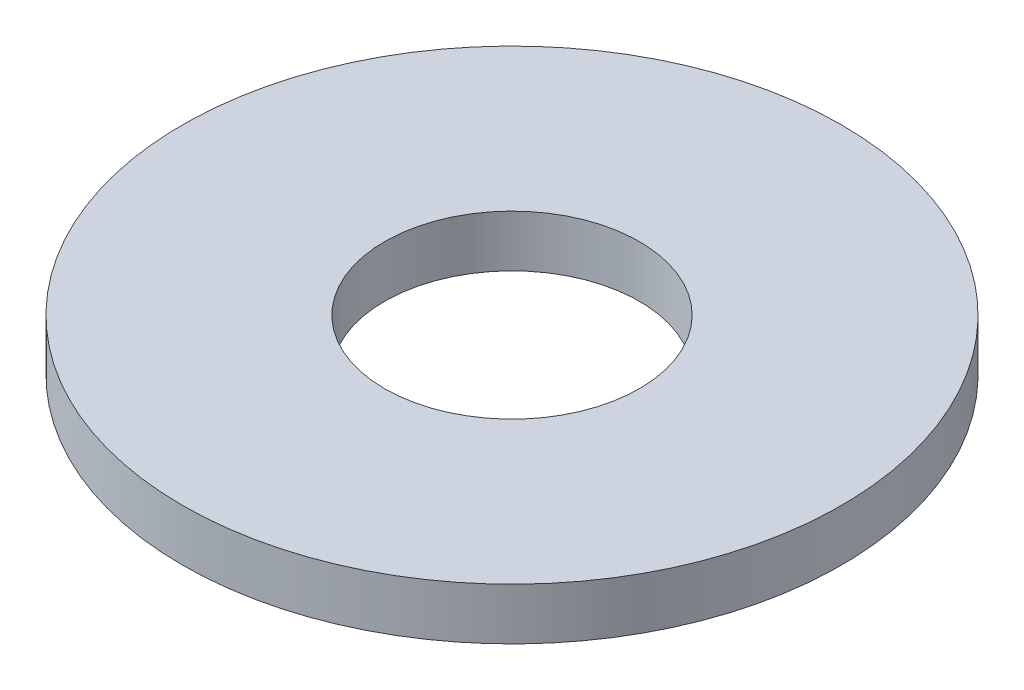
ISO-10303-21;
HEADER;
FILE_DESCRIPTION(('STEP AP214'),'2;1');
FILE_NAME('part.step','',(''),(''),'','','');
FILE_SCHEMA(('AUTOMOTIVE_DESIGN { 1 0 10303 214 1 1 1 1 }'));
ENDSEC;
DATA;
#1=APPLICATION_CONTEXT('core data for automotive mechanical design processes');
#2=APPLICATION_PROTOCOL_DEFINITION('international standard','automotive_design',2000,#1);
#3=PRODUCT_CONTEXT('',#1,'mechanical');
#4=PRODUCT('Part','Part','',(#3));
#5=PRODUCT_RELATED_PRODUCT_CATEGORY('part','',(#4));
#6=PRODUCT_DEFINITION_FORMATION('','',#4);
#7=PRODUCT_DEFINITION_CONTEXT('part definition',#1,'design');
#8=PRODUCT_DEFINITION('design','',#6,#7);
#9=PRODUCT_DEFINITION_SHAPE('','',#8);
#10=(LENGTH_UNIT() NAMED_UNIT(*) SI_UNIT(.MILLI.,.METRE.));
#11=(NAMED_UNIT(*) PLANE_ANGLE_UNIT() SI_UNIT($,.RADIAN.));
#12=(NAMED_UNIT(*) SI_UNIT($,.STERADIAN.) SOLID_ANGLE_UNIT());
#13=UNCERTAINTY_MEASURE_WITH_UNIT(LENGTH_MEASURE(1.E-05),#10,'distance_accuracy_value','');
#14=(GEOMETRIC_REPRESENTATION_CONTEXT(3) GLOBAL_UNCERTAINTY_ASSIGNED_CONTEXT((#13)) GLOBAL_UNIT_ASSIGNED_CONTEXT((#10,
#11,#12)) REPRESENTATION_CONTEXT('',''));
#15=CARTESIAN_POINT('',(0.,0.,0.));
#16=DIRECTION('',(0.,0.,1.));
#17=DIRECTION('',(1.,0.,0.));
#18=AXIS2_PLACEMENT_3D('',#15,#16,#17);
#19=CARTESIAN_POINT('',(0.,1.3716,0.));
#20=DIRECTION('',(0.,-1.,0.));
#21=DIRECTION('',(0.,0.,-1.));
#22=AXIS2_PLACEMENT_3D('',#19,#20,#21);
#23=CYLINDRICAL_SURFACE('',#22,8.7376);
#24=CARTESIAN_POINT('',(0.,1.3716,0.));
#25=DIRECTION('',(0.,1.,0.));
#26=DIRECTION('',(0.,0.,1.));
#27=AXIS2_PLACEMENT_3D('',#24,#25,#26);
#28=CIRCLE('',#27,8.7376);
#29=CARTESIAN_POINT('',(0.,1.3716,8.7376));
#30=VERTEX_POINT('',#29);
#31=EDGE_CURVE('E10',#30,#30,#28,.T.);
#32=ORIENTED_EDGE('',*,*,#31,.F.);
#33=EDGE_LOOP('',(#32));
#34=FACE_BOUND('',#33,.T.);
#35=CARTESIAN_POINT('',(0.,0.,0.));
#36=DIRECTION('',(0.,1.,0.));
#37=DIRECTION('',(0.,0.,1.));
#38=AXIS2_PLACEMENT_3D('',#35,#36,#37);
#39=CIRCLE('',#38,8.7376);
#40=CARTESIAN_POINT('',(0.,0.,8.7376));
#41=VERTEX_POINT('',#40);
#42=EDGE_CURVE('E35',#41,#41,#39,.T.);
#43=ORIENTED_EDGE('',*,*,#42,.T.);
#44=EDGE_LOOP('',(#43));
#45=FACE_BOUND('',#44,.T.);
#46=ADVANCED_FACE('F32',(#34,#45),#23,.T.);
#47=CARTESIAN_POINT('',(0.,1.3716,0.));
#48=DIRECTION('',(0.,1.,0.));
#49=DIRECTION('',(0.,0.,1.));
#50=AXIS2_PLACEMENT_3D('',#47,#48,#49);
#51=PLANE('',#50);
#52=CARTESIAN_POINT('',(0.,1.3716,0.));
#53=DIRECTION('',(0.,1.,0.));
#54=DIRECTION('',(0.,0.,1.));
#55=AXIS2_PLACEMENT_3D('',#52,#53,#54);
#56=CIRCLE('',#55,3.3782);
#57=CARTESIAN_POINT('',(0.,1.3716,3.3782));
#58=VERTEX_POINT('',#57);
#59=EDGE_CURVE('E44',#58,#58,#56,.T.);
#60=ORIENTED_EDGE('',*,*,#59,.F.);
#61=EDGE_LOOP('',(#60));
#62=FACE_BOUND('',#61,.T.);
#63=ORIENTED_EDGE('',*,*,#31,.T.);
#64=EDGE_LOOP('',(#63));
#65=FACE_BOUND('',#64,.T.);
#66=ADVANCED_FACE('F59',(#62,#65),#51,.T.);
#67=CARTESIAN_POINT('',(0.,0.,0.));
#68=DIRECTION('',(0.,1.,0.));
#69=DIRECTION('',(0.,0.,1.));
#70=AXIS2_PLACEMENT_3D('',#67,#68,#69);
#71=PLANE('',#70);
#72=CARTESIAN_POINT('',(0.,0.,0.));
#73=DIRECTION('',(0.,1.,0.));
#74=DIRECTION('',(0.,0.,1.));
#75=AXIS2_PLACEMENT_3D('',#72,#73,#74);
#76=CIRCLE('',#75,3.3782);
#77=CARTESIAN_POINT('',(0.,0.,3.3782));
#78=VERTEX_POINT('',#77);
#79=EDGE_CURVE('E42',#78,#78,#76,.T.);
#80=ORIENTED_EDGE('',*,*,#79,.T.);
#81=EDGE_LOOP('',(#80));
#82=FACE_BOUND('',#81,.T.);
#83=ORIENTED_EDGE('',*,*,#42,.F.);
#84=EDGE_LOOP('',(#83));
#85=FACE_BOUND('',#84,.T.);
#86=ADVANCED_FACE('F50',(#82,#85),#71,.F.);
#87=CARTESIAN_POINT('',(0.,0.,0.));
#88=DIRECTION('',(0.,1.,0.));
#89=DIRECTION('',(0.,0.,1.));
#90=AXIS2_PLACEMENT_3D('',#87,#88,#89);
#91=CYLINDRICAL_SURFACE('',#90,3.3782);
#92=ORIENTED_EDGE('',*,*,#79,.F.);
#93=EDGE_LOOP('',(#92));
#94=FACE_BOUND('',#93,.T.);
#95=ORIENTED_EDGE('',*,*,#59,.T.);
#96=EDGE_LOOP('',(#95));
#97=FACE_BOUND('',#96,.T.);
#98=ADVANCED_FACE('F53',(#94,#97),#91,.F.);
#99=CLOSED_SHELL('',(#46,#66,#86,#98));
#100=MANIFOLD_SOLID_BREP('B2',#99);
#101=ADVANCED_BREP_SHAPE_REPRESENTATION('',(#18,#100),#14);
#102=SHAPE_DEFINITION_REPRESENTATION(#9,#101);
ENDSEC;
END-ISO-10303-21;
